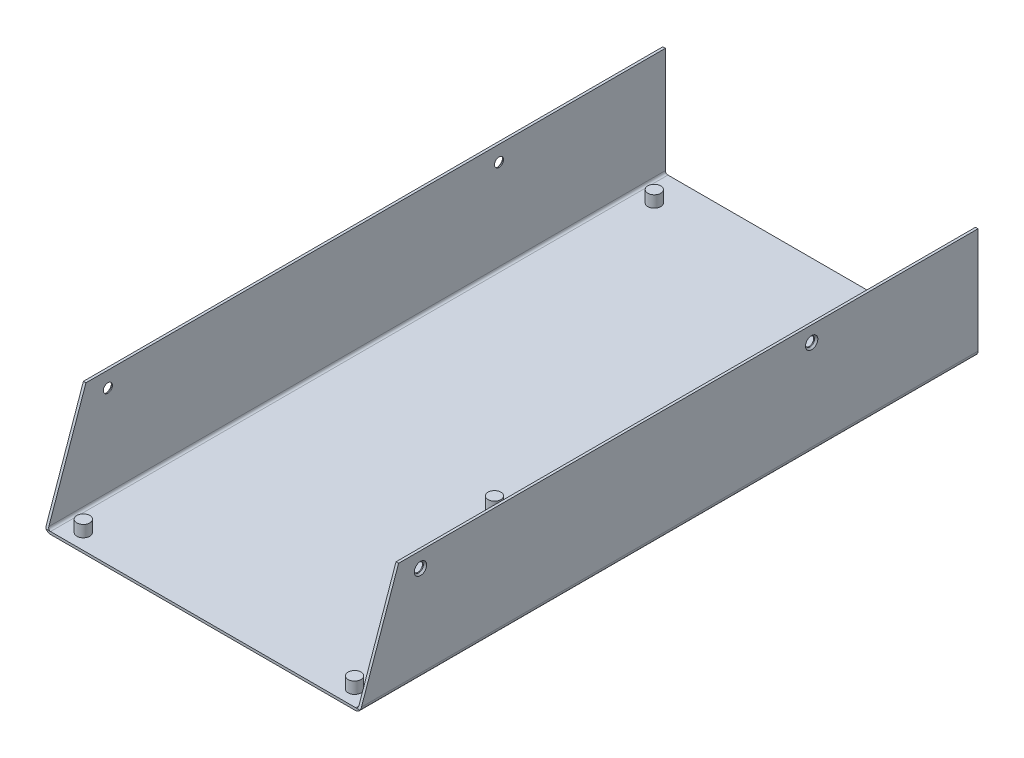
ISO-10303-21;
HEADER;
FILE_DESCRIPTION(('STEP AP214'),'2;1');
FILE_NAME('part.step','',(''),(''),'','','');
FILE_SCHEMA(('AUTOMOTIVE_DESIGN { 1 0 10303 214 1 1 1 1 }'));
ENDSEC;
DATA;
#1=APPLICATION_CONTEXT('core data for automotive mechanical design processes');
#2=APPLICATION_PROTOCOL_DEFINITION('international standard','automotive_design',2000,#1);
#3=PRODUCT_CONTEXT('',#1,'mechanical');
#4=PRODUCT('Part','Part','',(#3));
#5=PRODUCT_RELATED_PRODUCT_CATEGORY('part','',(#4));
#6=PRODUCT_DEFINITION_FORMATION('','',#4);
#7=PRODUCT_DEFINITION_CONTEXT('part definition',#1,'design');
#8=PRODUCT_DEFINITION('design','',#6,#7);
#9=PRODUCT_DEFINITION_SHAPE('','',#8);
#10=(LENGTH_UNIT() NAMED_UNIT(*) SI_UNIT(.MILLI.,.METRE.));
#11=(NAMED_UNIT(*) PLANE_ANGLE_UNIT() SI_UNIT($,.RADIAN.));
#12=(NAMED_UNIT(*) SI_UNIT($,.STERADIAN.) SOLID_ANGLE_UNIT());
#13=UNCERTAINTY_MEASURE_WITH_UNIT(LENGTH_MEASURE(1.E-05),#10,'distance_accuracy_value','');
#14=(GEOMETRIC_REPRESENTATION_CONTEXT(3) GLOBAL_UNCERTAINTY_ASSIGNED_CONTEXT((#13)) GLOBAL_UNIT_ASSIGNED_CONTEXT((#10,
#11,#12)) REPRESENTATION_CONTEXT('',''));
#15=CARTESIAN_POINT('',(0.,0.,0.));
#16=DIRECTION('',(0.,0.,1.));
#17=DIRECTION('',(1.,0.,0.));
#18=AXIS2_PLACEMENT_3D('',#15,#16,#17);
#19=CARTESIAN_POINT('',(120.0031128,0.9906,0.));
#20=DIRECTION('',(0.,-0.330401260882394,-0.943840562175267));
#21=DIRECTION('',(0.,0.943840562175267,-0.330401260882394));
#22=AXIS2_PLACEMENT_3D('',#19,#20,#21);
#23=PLANE('',#22);
#24=DIRECTION('',(-1.,0.,0.));
#25=VECTOR('',#24,1.);
#26=CARTESIAN_POINT('',(120.9996564,0.9906,0.));
#27=LINE('',#26,#25);
#28=CARTESIAN_POINT('',(121.730769529978,0.990600000000006,0.));
#29=VERTEX_POINT('',#28);
#30=CARTESIAN_POINT('',(120.015000000287,0.990600000000003,0.));
#31=VERTEX_POINT('',#30);
#32=EDGE_CURVE('E117',#29,#31,#27,.T.);
#33=ORIENTED_EDGE('',*,*,#32,.F.);
#34=CARTESIAN_POINT('',(120.015,1.9812,-0.34676989117291));
#35=DIRECTION('',(0.,-0.330401260882394,-0.943840562175267));
#36=DIRECTION('',(0.,-0.943840562175267,0.330401260882394));
#37=AXIS2_PLACEMENT_3D('',#34,#35,#36);
#38=ELLIPSE('',#37,2.09908334034082,1.98120000000002);
#39=CARTESIAN_POINT('',(121.9962,1.9812,-0.346769924921123));
#40=VERTEX_POINT('',#39);
#41=EDGE_CURVE('E246',#29,#40,#38,.F.);
#42=ORIENTED_EDGE('',*,*,#41,.T.);
#43=DIRECTION('',(0.,-0.943840562524939,0.330401259883503));
#44=VECTOR('',#43,1.);
#45=CARTESIAN_POINT('',(121.9962,43.0022,-14.7066000187628));
#46=LINE('',#45,#44);
#47=CARTESIAN_POINT('',(121.9962,43.0022,-14.7066000093814));
#48=VERTEX_POINT('',#47);
#49=EDGE_CURVE('E242',#48,#40,#46,.T.);
#50=ORIENTED_EDGE('',*,*,#49,.F.);
#51=DIRECTION('',(1.,0.,0.));
#52=VECTOR('',#51,1.);
#53=CARTESIAN_POINT('',(121.5009,43.0022,-14.7066));
#54=LINE('',#53,#52);
#55=CARTESIAN_POINT('',(121.0056,43.0022,-14.7066000093814));
#56=VERTEX_POINT('',#55);
#57=EDGE_CURVE('E153',#56,#48,#54,.T.);
#58=ORIENTED_EDGE('',*,*,#57,.F.);
#59=DIRECTION('',(0.,0.943840562524939,-0.330401259883503));
#60=VECTOR('',#59,1.);
#61=CARTESIAN_POINT('',(121.0056,1.9812,-0.346769958669363));
#62=LINE('',#61,#60);
#63=CARTESIAN_POINT('',(121.0056,1.9811999998221,-0.346769924858865));
#64=VERTEX_POINT('',#63);
#65=EDGE_CURVE('E151',#64,#56,#62,.T.);
#66=ORIENTED_EDGE('',*,*,#65,.F.);
#67=CARTESIAN_POINT('',(120.015,1.9812,-0.34676989117291));
#68=DIRECTION('',(0.,-0.330401260882394,-0.943840562175267));
#69=DIRECTION('',(0.,-0.943840562175267,0.330401260882394));
#70=AXIS2_PLACEMENT_3D('',#67,#68,#69);
#71=ELLIPSE('',#70,1.04954167017039,0.990599999999994);
#72=EDGE_CURVE('E128',#31,#64,#71,.F.);
#73=ORIENTED_EDGE('',*,*,#72,.F.);
#74=EDGE_LOOP('',(#33,#42,#50,#58,#66,#73));
#75=FACE_BOUND('',#74,.T.);
#76=ADVANCED_FACE('F32',(#75),#23,.F.);
#77=CARTESIAN_POINT('',(121.0056,43.0022,-238.9886));
#78=DIRECTION('',(0.,1.,0.));
#79=DIRECTION('',(0.,0.,1.));
#80=AXIS2_PLACEMENT_3D('',#77,#78,#79);
#81=PLANE('',#80);
#82=DIRECTION('',(-1.,0.,0.));
#83=VECTOR('',#82,1.);
#84=CARTESIAN_POINT('',(121.5009,43.0022,-238.9886));
#85=LINE('',#84,#83);
#86=CARTESIAN_POINT('',(121.9962,43.0022,-238.9886));
#87=VERTEX_POINT('',#86);
#88=CARTESIAN_POINT('',(121.005600001905,43.0022,-238.9886));
#89=VERTEX_POINT('',#88);
#90=EDGE_CURVE('E156',#87,#89,#85,.T.);
#91=ORIENTED_EDGE('',*,*,#90,.T.);
#92=DIRECTION('',(0.,0.,-1.));
#93=VECTOR('',#92,1.);
#94=CARTESIAN_POINT('',(121.0056,43.0022,-118.9517594544));
#95=LINE('',#94,#93);
#96=EDGE_CURVE('E239',#56,#89,#95,.T.);
#97=ORIENTED_EDGE('',*,*,#96,.F.);
#98=ORIENTED_EDGE('',*,*,#57,.T.);
#99=DIRECTION('',(0.,0.,1.));
#100=VECTOR('',#99,1.);
#101=CARTESIAN_POINT('',(121.9962,43.0022,-118.9517594544));
#102=LINE('',#101,#100);
#103=EDGE_CURVE('E241',#87,#48,#102,.T.);
#104=ORIENTED_EDGE('',*,*,#103,.F.);
#105=EDGE_LOOP('',(#91,#97,#98,#104));
#106=FACE_BOUND('',#105,.T.);
#107=ADVANCED_FACE('F351',(#106),#81,.T.);
#108=CARTESIAN_POINT('',(0.,0.9906,0.));
#109=DIRECTION('',(0.,-0.330401260882394,-0.943840562175267));
#110=DIRECTION('',(0.,0.943840562175267,-0.330401260882394));
#111=AXIS2_PLACEMENT_3D('',#108,#109,#110);
#112=PLANE('',#111);
#113=DIRECTION('',(1.,0.,0.));
#114=VECTOR('',#113,1.);
#115=CARTESIAN_POINT('',(0.4953,43.0022,-14.7066));
#116=LINE('',#115,#114);
#117=CARTESIAN_POINT('',(0.,43.0022,-14.7066000093814));
#118=VERTEX_POINT('',#117);
#119=CARTESIAN_POINT('',(0.9906,43.0022,-14.7066000093814));
#120=VERTEX_POINT('',#119);
#121=EDGE_CURVE('E254',#118,#120,#116,.T.);
#122=ORIENTED_EDGE('',*,*,#121,.F.);
#123=DIRECTION('',(0.,0.943840562524939,-0.330401259883503));
#124=VECTOR('',#123,1.);
#125=CARTESIAN_POINT('',(0.,1.9812,-0.346769958669363));
#126=LINE('',#125,#124);
#127=CARTESIAN_POINT('',(0.,1.9811999991873,-0.346769924636642));
#128=VERTEX_POINT('',#127);
#129=EDGE_CURVE('E250',#128,#118,#126,.T.);
#130=ORIENTED_EDGE('',*,*,#129,.F.);
#131=CARTESIAN_POINT('',(1.9812,1.9812,-0.34676989117291));
#132=DIRECTION('',(0.,-0.330401260882394,-0.943840562175267));
#133=DIRECTION('',(0.,-0.943840562175267,0.330401260882394));
#134=AXIS2_PLACEMENT_3D('',#131,#132,#133);
#135=ELLIPSE('',#134,2.0990833403408,1.9812);
#136=CARTESIAN_POINT('',(0.265430470022267,0.990600000000006,0.));
#137=VERTEX_POINT('',#136);
#138=EDGE_CURVE('E218',#128,#137,#135,.F.);
#139=ORIENTED_EDGE('',*,*,#138,.T.);
#140=DIRECTION('',(-1.,0.,0.));
#141=VECTOR('',#140,1.);
#142=CARTESIAN_POINT('',(0.9965436,0.9906,0.));
#143=LINE('',#142,#141);
#144=CARTESIAN_POINT('',(1.98119999990473,0.9906,0.));
#145=VERTEX_POINT('',#144);
#146=EDGE_CURVE('E259',#145,#137,#143,.T.);
#147=ORIENTED_EDGE('',*,*,#146,.F.);
#148=CARTESIAN_POINT('',(1.9812,1.9812,-0.34676989117291));
#149=DIRECTION('',(0.,-0.330401260882394,-0.943840562175267));
#150=DIRECTION('',(0.,-0.943840562175267,0.330401260882394));
#151=AXIS2_PLACEMENT_3D('',#148,#149,#150);
#152=ELLIPSE('',#151,1.0495416701704,0.9906);
#153=CARTESIAN_POINT('',(0.990600000000001,1.98119999959365,-0.346769924778889));
#154=VERTEX_POINT('',#153);
#155=EDGE_CURVE('E160',#154,#145,#152,.F.);
#156=ORIENTED_EDGE('',*,*,#155,.F.);
#157=DIRECTION('',(0.,-0.943840562524939,0.330401259883503));
#158=VECTOR('',#157,1.);
#159=CARTESIAN_POINT('',(0.9906,43.0022,-14.7066000187628));
#160=LINE('',#159,#158);
#161=EDGE_CURVE('E236',#120,#154,#160,.T.);
#162=ORIENTED_EDGE('',*,*,#161,.F.);
#163=EDGE_LOOP('',(#122,#130,#139,#147,#156,#162));
#164=FACE_BOUND('',#163,.T.);
#165=ADVANCED_FACE('F345',(#164),#112,.F.);
#166=CARTESIAN_POINT('',(0.,43.0022,-238.9886));
#167=DIRECTION('',(0.,1.,0.));
#168=DIRECTION('',(0.,0.,1.));
#169=AXIS2_PLACEMENT_3D('',#166,#167,#168);
#170=PLANE('',#169);
#171=DIRECTION('',(-1.,0.,0.));
#172=VECTOR('',#171,1.);
#173=CARTESIAN_POINT('',(0.4953,43.0022,-238.9886));
#174=LINE('',#173,#172);
#175=CARTESIAN_POINT('',(0.990599998095001,43.0022,-238.9886));
#176=VERTEX_POINT('',#175);
#177=CARTESIAN_POINT('',(0.,43.0022,-238.9886));
#178=VERTEX_POINT('',#177);
#179=EDGE_CURVE('E251',#176,#178,#174,.T.);
#180=ORIENTED_EDGE('',*,*,#179,.T.);
#181=DIRECTION('',(0.,0.,-1.));
#182=VECTOR('',#181,1.);
#183=CARTESIAN_POINT('',(0.,43.0022,-118.9517594544));
#184=LINE('',#183,#182);
#185=EDGE_CURVE('E208',#118,#178,#184,.T.);
#186=ORIENTED_EDGE('',*,*,#185,.F.);
#187=ORIENTED_EDGE('',*,*,#121,.T.);
#188=DIRECTION('',(0.,0.,1.));
#189=VECTOR('',#188,1.);
#190=CARTESIAN_POINT('',(0.9906,43.0022,-118.9517594544));
#191=LINE('',#190,#189);
#192=EDGE_CURVE('E235',#176,#120,#191,.T.);
#193=ORIENTED_EDGE('',*,*,#192,.F.);
#194=EDGE_LOOP('',(#180,#186,#187,#193));
#195=FACE_BOUND('',#194,.T.);
#196=ADVANCED_FACE('F195',(#195),#170,.T.);
#197=CARTESIAN_POINT('',(0.,1.9812,-238.9886));
#198=DIRECTION('',(-1.,0.,0.));
#199=DIRECTION('',(0.,0.,1.));
#200=AXIS2_PLACEMENT_3D('',#197,#198,#199);
#201=PLANE('',#200);
#202=CARTESIAN_POINT('',(0.,37.0078,-174.5996));
#203=DIRECTION('',(-1.,0.,0.));
#204=DIRECTION('',(0.,0.,1.));
#205=AXIS2_PLACEMENT_3D('',#202,#203,#204);
#206=CIRCLE('',#205,2.38760000000002);
#207=CARTESIAN_POINT('',(0.,37.0078,-172.212));
#208=VERTEX_POINT('',#207);
#209=EDGE_CURVE('E178',#208,#208,#206,.F.);
#210=ORIENTED_EDGE('',*,*,#209,.T.);
#211=EDGE_LOOP('',(#210));
#212=FACE_BOUND('',#211,.T.);
#213=CARTESIAN_POINT('',(0.,37.0078,-23.1902));
#214=DIRECTION('',(-1.,0.,0.));
#215=DIRECTION('',(0.,0.,1.));
#216=AXIS2_PLACEMENT_3D('',#213,#214,#215);
#217=CIRCLE('',#216,2.38760000000002);
#218=CARTESIAN_POINT('',(0.,37.0078,-20.8026));
#219=VERTEX_POINT('',#218);
#220=EDGE_CURVE('E175',#219,#219,#217,.F.);
#221=ORIENTED_EDGE('',*,*,#220,.T.);
#222=EDGE_LOOP('',(#221));
#223=FACE_BOUND('',#222,.T.);
#224=DIRECTION('',(0.,-1.,0.));
#225=VECTOR('',#224,1.);
#226=CARTESIAN_POINT('',(0.,21.5011,-238.9886));
#227=LINE('',#226,#225);
#228=CARTESIAN_POINT('',(0.,1.98119999959365,-238.9886));
#229=VERTEX_POINT('',#228);
#230=EDGE_CURVE('E202',#178,#229,#227,.T.);
#231=ORIENTED_EDGE('',*,*,#230,.T.);
#232=DIRECTION('',(0.,0.,-1.));
#233=VECTOR('',#232,1.);
#234=CARTESIAN_POINT('',(0.,1.9811999991873,-119.4943));
#235=LINE('',#234,#233);
#236=EDGE_CURVE('E205',#229,#128,#235,.F.);
#237=ORIENTED_EDGE('',*,*,#236,.T.);
#238=ORIENTED_EDGE('',*,*,#129,.T.);
#239=ORIENTED_EDGE('',*,*,#185,.T.);
#240=EDGE_LOOP('',(#231,#237,#238,#239));
#241=FACE_BOUND('',#240,.T.);
#242=ADVANCED_FACE('F191',(#212,#223,#241),#201,.T.);
#243=CARTESIAN_POINT('',(1.9812,1.9812,-238.9886));
#244=DIRECTION('',(0.,0.,1.));
#245=DIRECTION('',(1.,0.,0.));
#246=AXIS2_PLACEMENT_3D('',#243,#244,#245);
#247=CYLINDRICAL_SURFACE('',#246,1.9812);
#248=ORIENTED_EDGE('',*,*,#236,.F.);
#249=CARTESIAN_POINT('',(1.9812,1.9812,-238.9886));
#250=DIRECTION('',(0.,0.,1.));
#251=DIRECTION('',(1.,0.,0.));
#252=AXIS2_PLACEMENT_3D('',#249,#250,#251);
#253=CIRCLE('',#252,1.9812);
#254=CARTESIAN_POINT('',(1.9812,0.,-238.9886));
#255=VERTEX_POINT('',#254);
#256=EDGE_CURVE('E211',#229,#255,#253,.T.);
#257=ORIENTED_EDGE('',*,*,#256,.T.);
#258=DIRECTION('',(0.,0.,-1.));
#259=VECTOR('',#258,1.);
#260=CARTESIAN_POINT('',(1.9812,0.,-119.4943));
#261=LINE('',#260,#259);
#262=CARTESIAN_POINT('',(1.9812,0.,0.));
#263=VERTEX_POINT('',#262);
#264=EDGE_CURVE('E249',#263,#255,#261,.T.);
#265=ORIENTED_EDGE('',*,*,#264,.F.);
#266=CARTESIAN_POINT('',(1.9812,1.9812,0.));
#267=DIRECTION('',(0.,0.,1.));
#268=DIRECTION('',(1.,0.,0.));
#269=AXIS2_PLACEMENT_3D('',#266,#267,#268);
#270=CIRCLE('',#269,1.9812);
#271=EDGE_CURVE('E232',#137,#263,#270,.T.);
#272=ORIENTED_EDGE('',*,*,#271,.F.);
#273=ORIENTED_EDGE('',*,*,#138,.F.);
#274=EDGE_LOOP('',(#248,#257,#265,#272,#273));
#275=FACE_BOUND('',#274,.T.);
#276=ADVANCED_FACE('F194',(#275),#247,.T.);
#277=CARTESIAN_POINT('',(1.9812,0.,0.));
#278=DIRECTION('',(0.,-1.,0.));
#279=DIRECTION('',(0.,0.,-1.));
#280=AXIS2_PLACEMENT_3D('',#277,#278,#279);
#281=PLANE('',#280);
#282=DIRECTION('',(1.,0.,0.));
#283=VECTOR('',#282,1.);
#284=CARTESIAN_POINT('',(60.9981,0.,-238.9886));
#285=LINE('',#284,#283);
#286=CARTESIAN_POINT('',(120.014999999619,0.,-238.9886));
#287=VERTEX_POINT('',#286);
#288=EDGE_CURVE('E223',#255,#287,#285,.T.);
#289=ORIENTED_EDGE('',*,*,#288,.T.);
#290=DIRECTION('',(0.,0.,-1.));
#291=VECTOR('',#290,1.);
#292=CARTESIAN_POINT('',(120.014999999238,0.,-119.4943));
#293=LINE('',#292,#291);
#294=CARTESIAN_POINT('',(120.014999999619,0.,0.));
#295=VERTEX_POINT('',#294);
#296=EDGE_CURVE('E248',#287,#295,#293,.F.);
#297=ORIENTED_EDGE('',*,*,#296,.T.);
#298=DIRECTION('',(1.,0.,0.));
#299=VECTOR('',#298,1.);
#300=CARTESIAN_POINT('',(60.9981,0.,0.));
#301=LINE('',#300,#299);
#302=EDGE_CURVE('E231',#263,#295,#301,.T.);
#303=ORIENTED_EDGE('',*,*,#302,.F.);
#304=ORIENTED_EDGE('',*,*,#264,.T.);
#305=EDGE_LOOP('',(#289,#297,#303,#304));
#306=FACE_BOUND('',#305,.T.);
#307=ADVANCED_FACE('F342',(#306),#281,.T.);
#308=CARTESIAN_POINT('',(120.015,1.9812,-238.9886));
#309=DIRECTION('',(0.,0.,1.));
#310=DIRECTION('',(1.,0.,0.));
#311=AXIS2_PLACEMENT_3D('',#308,#309,#310);
#312=CYLINDRICAL_SURFACE('',#311,1.98120000000002);
#313=CARTESIAN_POINT('',(120.015,1.9812,0.));
#314=DIRECTION('',(0.,0.,1.));
#315=DIRECTION('',(1.,0.,0.));
#316=AXIS2_PLACEMENT_3D('',#313,#314,#315);
#317=CIRCLE('',#316,1.98120000000002);
#318=EDGE_CURVE('E124',#295,#29,#317,.T.);
#319=ORIENTED_EDGE('',*,*,#318,.F.);
#320=ORIENTED_EDGE('',*,*,#296,.F.);
#321=CARTESIAN_POINT('',(120.015,1.9812,-238.9886));
#322=DIRECTION('',(0.,0.,1.));
#323=DIRECTION('',(1.,0.,0.));
#324=AXIS2_PLACEMENT_3D('',#321,#322,#323);
#325=CIRCLE('',#324,1.98120000000002);
#326=CARTESIAN_POINT('',(121.9962,1.9812,-238.9886));
#327=VERTEX_POINT('',#326);
#328=EDGE_CURVE('E225',#287,#327,#325,.T.);
#329=ORIENTED_EDGE('',*,*,#328,.T.);
#330=DIRECTION('',(0.,0.,-1.));
#331=VECTOR('',#330,1.);
#332=CARTESIAN_POINT('',(121.9962,1.9812,-118.9517594544));
#333=LINE('',#332,#331);
#334=EDGE_CURVE('E245',#40,#327,#333,.T.);
#335=ORIENTED_EDGE('',*,*,#334,.F.);
#336=ORIENTED_EDGE('',*,*,#41,.F.);
#337=EDGE_LOOP('',(#319,#320,#329,#335,#336));
#338=FACE_BOUND('',#337,.T.);
#339=ADVANCED_FACE('F394',(#338),#312,.T.);
#340=CARTESIAN_POINT('',(121.9962,1.9812,1.0850810912));
#341=DIRECTION('',(1.,0.,0.));
#342=DIRECTION('',(0.,0.,-1.));
#343=AXIS2_PLACEMENT_3D('',#340,#341,#342);
#344=PLANE('',#343);
#345=CARTESIAN_POINT('',(121.9962,37.0078,-174.5996));
#346=DIRECTION('',(1.,0.,0.));
#347=DIRECTION('',(0.,0.,-1.));
#348=AXIS2_PLACEMENT_3D('',#345,#346,#347);
#349=CIRCLE('',#348,2.38759999999999);
#350=CARTESIAN_POINT('',(121.9962,37.0078,-176.9872));
#351=VERTEX_POINT('',#350);
#352=EDGE_CURVE('E169',#351,#351,#349,.F.);
#353=ORIENTED_EDGE('',*,*,#352,.T.);
#354=EDGE_LOOP('',(#353));
#355=FACE_BOUND('',#354,.T.);
#356=CARTESIAN_POINT('',(121.9962,37.0078,-23.1902));
#357=DIRECTION('',(1.,0.,0.));
#358=DIRECTION('',(0.,0.,-1.));
#359=AXIS2_PLACEMENT_3D('',#356,#357,#358);
#360=CIRCLE('',#359,2.38760000000007);
#361=CARTESIAN_POINT('',(121.9962,37.0078,-25.5778000000001));
#362=VERTEX_POINT('',#361);
#363=EDGE_CURVE('E162',#362,#362,#360,.F.);
#364=ORIENTED_EDGE('',*,*,#363,.T.);
#365=EDGE_LOOP('',(#364));
#366=FACE_BOUND('',#365,.T.);
#367=DIRECTION('',(0.,1.,0.));
#368=VECTOR('',#367,1.);
#369=CARTESIAN_POINT('',(121.9962,21.5011,-238.9886));
#370=LINE('',#369,#368);
#371=EDGE_CURVE('E304',#327,#87,#370,.T.);
#372=ORIENTED_EDGE('',*,*,#371,.T.);
#373=ORIENTED_EDGE('',*,*,#103,.T.);
#374=ORIENTED_EDGE('',*,*,#49,.T.);
#375=ORIENTED_EDGE('',*,*,#334,.T.);
#376=EDGE_LOOP('',(#372,#373,#374,#375));
#377=FACE_BOUND('',#376,.T.);
#378=ADVANCED_FACE('F397',(#355,#366,#377),#344,.T.);
#379=CARTESIAN_POINT('',(121.0056,1.9812,-238.9886));
#380=DIRECTION('',(-1.,0.,0.));
#381=DIRECTION('',(0.,0.,1.));
#382=AXIS2_PLACEMENT_3D('',#379,#380,#381);
#383=PLANE('',#382);
#384=CARTESIAN_POINT('',(121.0056,37.0078,-174.5996));
#385=DIRECTION('',(-1.,0.,0.));
#386=DIRECTION('',(0.,0.,1.));
#387=AXIS2_PLACEMENT_3D('',#384,#385,#386);
#388=CIRCLE('',#387,1.7526);
#389=CARTESIAN_POINT('',(121.0056,37.0078,-172.847));
#390=VERTEX_POINT('',#389);
#391=EDGE_CURVE('E627',#390,#390,#388,.T.);
#392=ORIENTED_EDGE('',*,*,#391,.F.);
#393=EDGE_LOOP('',(#392));
#394=FACE_BOUND('',#393,.T.);
#395=CARTESIAN_POINT('',(121.0056,37.0078,-23.1902));
#396=DIRECTION('',(-1.,0.,0.));
#397=DIRECTION('',(0.,0.,1.));
#398=AXIS2_PLACEMENT_3D('',#395,#396,#397);
#399=CIRCLE('',#398,1.7526);
#400=CARTESIAN_POINT('',(121.0056,37.0078,-21.4376));
#401=VERTEX_POINT('',#400);
#402=EDGE_CURVE('E129',#401,#401,#399,.T.);
#403=ORIENTED_EDGE('',*,*,#402,.F.);
#404=EDGE_LOOP('',(#403));
#405=FACE_BOUND('',#404,.T.);
#406=DIRECTION('',(0.,-1.,0.));
#407=VECTOR('',#406,1.);
#408=CARTESIAN_POINT('',(121.005600005715,21.5011,-238.9886));
#409=LINE('',#408,#407);
#410=CARTESIAN_POINT('',(121.005600002857,1.98119999991105,-238.9886));
#411=VERTEX_POINT('',#410);
#412=EDGE_CURVE('E301',#89,#411,#409,.T.);
#413=ORIENTED_EDGE('',*,*,#412,.T.);
#414=DIRECTION('',(0.,0.,1.));
#415=VECTOR('',#414,1.);
#416=CARTESIAN_POINT('',(121.0056,1.9811999998221,-118.7773342));
#417=LINE('',#416,#415);
#418=EDGE_CURVE('E212',#64,#411,#417,.F.);
#419=ORIENTED_EDGE('',*,*,#418,.F.);
#420=ORIENTED_EDGE('',*,*,#65,.T.);
#421=ORIENTED_EDGE('',*,*,#96,.T.);
#422=EDGE_LOOP('',(#413,#419,#420,#421));
#423=FACE_BOUND('',#422,.T.);
#424=ADVANCED_FACE('F411',(#394,#405,#423),#383,.T.);
#425=CARTESIAN_POINT('',(0.9906,1.9812,1.0850810912));
#426=DIRECTION('',(1.,0.,0.));
#427=DIRECTION('',(0.,0.,-1.));
#428=AXIS2_PLACEMENT_3D('',#425,#426,#427);
#429=PLANE('',#428);
#430=CARTESIAN_POINT('',(0.9906,37.0078,-174.5996));
#431=DIRECTION('',(1.,0.,0.));
#432=DIRECTION('',(0.,0.,-1.));
#433=AXIS2_PLACEMENT_3D('',#430,#431,#432);
#434=CIRCLE('',#433,1.7526);
#435=CARTESIAN_POINT('',(0.9906,37.0078,-176.3522));
#436=VERTEX_POINT('',#435);
#437=EDGE_CURVE('E628',#436,#436,#434,.T.);
#438=ORIENTED_EDGE('',*,*,#437,.F.);
#439=EDGE_LOOP('',(#438));
#440=FACE_BOUND('',#439,.T.);
#441=CARTESIAN_POINT('',(0.9906,37.0078,-23.1902));
#442=DIRECTION('',(1.,0.,0.));
#443=DIRECTION('',(0.,0.,-1.));
#444=AXIS2_PLACEMENT_3D('',#441,#442,#443);
#445=CIRCLE('',#444,1.7526);
#446=CARTESIAN_POINT('',(0.9906,37.0078,-24.9428));
#447=VERTEX_POINT('',#446);
#448=EDGE_CURVE('E626',#447,#447,#445,.T.);
#449=ORIENTED_EDGE('',*,*,#448,.F.);
#450=EDGE_LOOP('',(#449));
#451=FACE_BOUND('',#450,.T.);
#452=DIRECTION('',(0.,1.,0.));
#453=VECTOR('',#452,1.);
#454=CARTESIAN_POINT('',(0.990599994285,21.5011,-238.9886));
#455=LINE('',#454,#453);
#456=CARTESIAN_POINT('',(0.9905999971425,1.98119999979683,-238.9886));
#457=VERTEX_POINT('',#456);
#458=EDGE_CURVE('E300',#457,#176,#455,.T.);
#459=ORIENTED_EDGE('',*,*,#458,.T.);
#460=ORIENTED_EDGE('',*,*,#192,.T.);
#461=ORIENTED_EDGE('',*,*,#161,.T.);
#462=DIRECTION('',(0.,0.,-1.));
#463=VECTOR('',#462,1.);
#464=CARTESIAN_POINT('',(0.990600000000001,1.98119999959365,-118.7773342));
#465=LINE('',#464,#463);
#466=EDGE_CURVE('E299',#457,#154,#465,.F.);
#467=ORIENTED_EDGE('',*,*,#466,.F.);
#468=EDGE_LOOP('',(#459,#460,#461,#467));
#469=FACE_BOUND('',#468,.T.);
#470=ADVANCED_FACE('F416',(#440,#451,#469),#429,.T.);
#471=CARTESIAN_POINT('',(116.2223228,5.4864,-204.1571228));
#472=DIRECTION('',(0.,1.,0.));
#473=DIRECTION('',(-1.,0.,0.));
#474=AXIS2_PLACEMENT_3D('',#471,#472,#473);
#475=PLANE('',#474);
#476=CARTESIAN_POINT('',(113.6904,5.4864,-201.6252));
#477=DIRECTION('',(0.,-1.,0.));
#478=DIRECTION('',(0.,0.,-1.));
#479=AXIS2_PLACEMENT_3D('',#476,#477,#478);
#480=CIRCLE('',#479,2.50189999999996);
#481=CARTESIAN_POINT('',(113.6904,5.4864,-204.1271));
#482=VERTEX_POINT('',#481);
#483=EDGE_CURVE('E296',#482,#482,#480,.F.);
#484=ORIENTED_EDGE('',*,*,#483,.T.);
#485=EDGE_LOOP('',(#484));
#486=FACE_BOUND('',#485,.T.);
#487=ADVANCED_FACE('F418',(#486),#475,.T.);
#488=CARTESIAN_POINT('',(82.9737228,5.4864,-95.9023228));
#489=DIRECTION('',(0.,1.,0.));
#490=DIRECTION('',(-1.,0.,0.));
#491=AXIS2_PLACEMENT_3D('',#488,#489,#490);
#492=PLANE('',#491);
#493=CARTESIAN_POINT('',(80.4418,5.4864,-93.3704));
#494=DIRECTION('',(0.,-1.,0.));
#495=DIRECTION('',(0.,0.,-1.));
#496=AXIS2_PLACEMENT_3D('',#493,#494,#495);
#497=CIRCLE('',#496,2.5019);
#498=CARTESIAN_POINT('',(80.4418,5.4864,-95.8723));
#499=VERTEX_POINT('',#498);
#500=EDGE_CURVE('E293',#499,#499,#497,.F.);
#501=ORIENTED_EDGE('',*,*,#500,.T.);
#502=EDGE_LOOP('',(#501));
#503=FACE_BOUND('',#502,.T.);
#504=ADVANCED_FACE('F425',(#503),#492,.T.);
#505=CARTESIAN_POINT('',(116.2223228,5.4864,-8.5263228));
#506=DIRECTION('',(0.,1.,0.));
#507=DIRECTION('',(-1.,0.,0.));
#508=AXIS2_PLACEMENT_3D('',#505,#506,#507);
#509=PLANE('',#508);
#510=CARTESIAN_POINT('',(113.6904,5.4864,-5.9944));
#511=DIRECTION('',(0.,-1.,0.));
#512=DIRECTION('',(0.,0.,-1.));
#513=AXIS2_PLACEMENT_3D('',#510,#511,#512);
#514=CIRCLE('',#513,2.50189999999996);
#515=CARTESIAN_POINT('',(113.6904,5.4864,-8.49629999999996));
#516=VERTEX_POINT('',#515);
#517=EDGE_CURVE('E290',#516,#516,#514,.F.);
#518=ORIENTED_EDGE('',*,*,#517,.T.);
#519=EDGE_LOOP('',(#518));
#520=FACE_BOUND('',#519,.T.);
#521=ADVANCED_FACE('F436',(#520),#509,.T.);
#522=CARTESIAN_POINT('',(11.2187228,5.4864,-8.5263228));
#523=DIRECTION('',(0.,1.,0.));
#524=DIRECTION('',(-1.,0.,0.));
#525=AXIS2_PLACEMENT_3D('',#522,#523,#524);
#526=PLANE('',#525);
#527=CARTESIAN_POINT('',(8.6868,5.4864,-5.9944));
#528=DIRECTION('',(0.,-1.,0.));
#529=DIRECTION('',(0.,0.,-1.));
#530=AXIS2_PLACEMENT_3D('',#527,#528,#529);
#531=CIRCLE('',#530,2.5019);
#532=CARTESIAN_POINT('',(8.6868,5.4864,-8.4963));
#533=VERTEX_POINT('',#532);
#534=EDGE_CURVE('E139',#533,#533,#531,.F.);
#535=ORIENTED_EDGE('',*,*,#534,.T.);
#536=EDGE_LOOP('',(#535));
#537=FACE_BOUND('',#536,.T.);
#538=ADVANCED_FACE('F440',(#537),#526,.T.);
#539=CARTESIAN_POINT('',(-0.4633615574,0.,0.));
#540=DIRECTION('',(0.,0.,1.));
#541=DIRECTION('',(1.,0.,0.));
#542=AXIS2_PLACEMENT_3D('',#539,#540,#541);
#543=PLANE('',#542);
#544=ORIENTED_EDGE('',*,*,#32,.T.);
#545=DIRECTION('',(1.,0.,0.));
#546=VECTOR('',#545,1.);
#547=CARTESIAN_POINT('',(60.9981,0.9906,0.));
#548=LINE('',#547,#546);
#549=EDGE_CURVE('E120',#145,#31,#548,.T.);
#550=ORIENTED_EDGE('',*,*,#549,.F.);
#551=ORIENTED_EDGE('',*,*,#146,.T.);
#552=ORIENTED_EDGE('',*,*,#271,.T.);
#553=ORIENTED_EDGE('',*,*,#302,.T.);
#554=ORIENTED_EDGE('',*,*,#318,.T.);
#555=EDGE_LOOP('',(#544,#550,#551,#552,#553,#554));
#556=FACE_BOUND('',#555,.T.);
#557=ADVANCED_FACE('F119',(#556),#543,.T.);
#558=CARTESIAN_POINT('',(120.015,1.9812,-238.9886));
#559=DIRECTION('',(0.,0.,1.));
#560=DIRECTION('',(1.,0.,0.));
#561=AXIS2_PLACEMENT_3D('',#558,#559,#560);
#562=CYLINDRICAL_SURFACE('',#561,0.990599999999994);
#563=CARTESIAN_POINT('',(120.015,1.9812,-238.9886));
#564=DIRECTION('',(0.,0.,1.));
#565=DIRECTION('',(1.,0.,0.));
#566=AXIS2_PLACEMENT_3D('',#563,#564,#565);
#567=CIRCLE('',#566,0.990599999999994);
#568=CARTESIAN_POINT('',(120.015,0.9906,-238.9886));
#569=VERTEX_POINT('',#568);
#570=EDGE_CURVE('E147',#411,#569,#567,.F.);
#571=ORIENTED_EDGE('',*,*,#570,.T.);
#572=DIRECTION('',(0.,0.,-1.));
#573=VECTOR('',#572,1.);
#574=CARTESIAN_POINT('',(120.015,0.9906,-119.4943));
#575=LINE('',#574,#573);
#576=EDGE_CURVE('E137',#31,#569,#575,.T.);
#577=ORIENTED_EDGE('',*,*,#576,.F.);
#578=ORIENTED_EDGE('',*,*,#72,.T.);
#579=ORIENTED_EDGE('',*,*,#418,.T.);
#580=EDGE_LOOP('',(#571,#577,#578,#579));
#581=FACE_BOUND('',#580,.T.);
#582=ADVANCED_FACE('F143',(#581),#562,.F.);
#583=CARTESIAN_POINT('',(0.,0.,-238.9886));
#584=DIRECTION('',(0.,0.,1.));
#585=DIRECTION('',(1.,0.,0.));
#586=AXIS2_PLACEMENT_3D('',#583,#584,#585);
#587=PLANE('',#586);
#588=ORIENTED_EDGE('',*,*,#458,.F.);
#589=CARTESIAN_POINT('',(1.9812,1.9812,-238.9886));
#590=DIRECTION('',(0.,0.,1.));
#591=DIRECTION('',(1.,0.,0.));
#592=AXIS2_PLACEMENT_3D('',#589,#590,#591);
#593=CIRCLE('',#592,0.9906);
#594=CARTESIAN_POINT('',(1.9812,0.9906,-238.9886));
#595=VERTEX_POINT('',#594);
#596=EDGE_CURVE('E49',#595,#457,#593,.F.);
#597=ORIENTED_EDGE('',*,*,#596,.F.);
#598=DIRECTION('',(-1.,0.,0.));
#599=VECTOR('',#598,1.);
#600=CARTESIAN_POINT('',(60.9981,0.9906,-238.9886));
#601=LINE('',#600,#599);
#602=EDGE_CURVE('E148',#569,#595,#601,.T.);
#603=ORIENTED_EDGE('',*,*,#602,.F.);
#604=ORIENTED_EDGE('',*,*,#570,.F.);
#605=ORIENTED_EDGE('',*,*,#412,.F.);
#606=ORIENTED_EDGE('',*,*,#90,.F.);
#607=ORIENTED_EDGE('',*,*,#371,.F.);
#608=ORIENTED_EDGE('',*,*,#328,.F.);
#609=ORIENTED_EDGE('',*,*,#288,.F.);
#610=ORIENTED_EDGE('',*,*,#256,.F.);
#611=ORIENTED_EDGE('',*,*,#230,.F.);
#612=ORIENTED_EDGE('',*,*,#179,.F.);
#613=EDGE_LOOP('',(#588,#597,#603,#604,#605,#606,#607,#608,#609,#610,#611,#612));
#614=FACE_BOUND('',#613,.T.);
#615=ADVANCED_FACE('F221',(#614),#587,.F.);
#616=CARTESIAN_POINT('',(1.9812,1.9812,-238.9886));
#617=DIRECTION('',(0.,0.,1.));
#618=DIRECTION('',(1.,0.,0.));
#619=AXIS2_PLACEMENT_3D('',#616,#617,#618);
#620=CYLINDRICAL_SURFACE('',#619,0.9906);
#621=ORIENTED_EDGE('',*,*,#596,.T.);
#622=ORIENTED_EDGE('',*,*,#466,.T.);
#623=ORIENTED_EDGE('',*,*,#155,.T.);
#624=DIRECTION('',(0.,0.,1.));
#625=VECTOR('',#624,1.);
#626=CARTESIAN_POINT('',(1.9812,0.9906,-119.4943));
#627=LINE('',#626,#625);
#628=EDGE_CURVE('E138',#595,#145,#627,.T.);
#629=ORIENTED_EDGE('',*,*,#628,.F.);
#630=EDGE_LOOP('',(#621,#622,#623,#629));
#631=FACE_BOUND('',#630,.T.);
#632=ADVANCED_FACE('F387',(#631),#620,.F.);
#633=CARTESIAN_POINT('',(113.6904,5.4864,-201.6252));
#634=DIRECTION('',(0.,-1.,0.));
#635=DIRECTION('',(0.,0.,-1.));
#636=AXIS2_PLACEMENT_3D('',#633,#634,#635);
#637=CYLINDRICAL_SURFACE('',#636,2.50189999999996);
#638=CARTESIAN_POINT('',(113.6904,0.9906,-201.6252));
#639=DIRECTION('',(0.,-1.,0.));
#640=DIRECTION('',(0.,0.,-1.));
#641=AXIS2_PLACEMENT_3D('',#638,#639,#640);
#642=CIRCLE('',#641,2.50189999999996);
#643=CARTESIAN_POINT('',(113.6904,0.9906,-204.1271));
#644=VERTEX_POINT('',#643);
#645=EDGE_CURVE('E285',#644,#644,#642,.T.);
#646=ORIENTED_EDGE('',*,*,#645,.F.);
#647=EDGE_LOOP('',(#646));
#648=FACE_BOUND('',#647,.T.);
#649=ORIENTED_EDGE('',*,*,#483,.F.);
#650=EDGE_LOOP('',(#649));
#651=FACE_BOUND('',#650,.T.);
#652=ADVANCED_FACE('F383',(#648,#651),#637,.T.);
#653=CARTESIAN_POINT('',(80.4418,5.4864,-93.3704));
#654=DIRECTION('',(0.,-1.,0.));
#655=DIRECTION('',(0.,0.,-1.));
#656=AXIS2_PLACEMENT_3D('',#653,#654,#655);
#657=CYLINDRICAL_SURFACE('',#656,2.5019);
#658=CARTESIAN_POINT('',(80.4418,0.9906,-93.3704));
#659=DIRECTION('',(0.,-1.,0.));
#660=DIRECTION('',(0.,0.,-1.));
#661=AXIS2_PLACEMENT_3D('',#658,#659,#660);
#662=CIRCLE('',#661,2.5019);
#663=CARTESIAN_POINT('',(80.4418,0.9906,-95.8723));
#664=VERTEX_POINT('',#663);
#665=EDGE_CURVE('E282',#664,#664,#662,.T.);
#666=ORIENTED_EDGE('',*,*,#665,.F.);
#667=EDGE_LOOP('',(#666));
#668=FACE_BOUND('',#667,.T.);
#669=ORIENTED_EDGE('',*,*,#500,.F.);
#670=EDGE_LOOP('',(#669));
#671=FACE_BOUND('',#670,.T.);
#672=ADVANCED_FACE('F379',(#668,#671),#657,.T.);
#673=CARTESIAN_POINT('',(113.6904,5.4864,-5.9944));
#674=DIRECTION('',(0.,-1.,0.));
#675=DIRECTION('',(0.,0.,-1.));
#676=AXIS2_PLACEMENT_3D('',#673,#674,#675);
#677=CYLINDRICAL_SURFACE('',#676,2.50189999999996);
#678=CARTESIAN_POINT('',(113.6904,0.9906,-5.9944));
#679=DIRECTION('',(0.,-1.,0.));
#680=DIRECTION('',(0.,0.,-1.));
#681=AXIS2_PLACEMENT_3D('',#678,#679,#680);
#682=CIRCLE('',#681,2.50189999999996);
#683=CARTESIAN_POINT('',(113.6904,0.9906,-8.49629999999996));
#684=VERTEX_POINT('',#683);
#685=EDGE_CURVE('E279',#684,#684,#682,.T.);
#686=ORIENTED_EDGE('',*,*,#685,.F.);
#687=EDGE_LOOP('',(#686));
#688=FACE_BOUND('',#687,.T.);
#689=ORIENTED_EDGE('',*,*,#517,.F.);
#690=EDGE_LOOP('',(#689));
#691=FACE_BOUND('',#690,.T.);
#692=ADVANCED_FACE('F375',(#688,#691),#677,.T.);
#693=CARTESIAN_POINT('',(8.6868,5.4864,-5.9944));
#694=DIRECTION('',(0.,-1.,0.));
#695=DIRECTION('',(0.,0.,-1.));
#696=AXIS2_PLACEMENT_3D('',#693,#694,#695);
#697=CYLINDRICAL_SURFACE('',#696,2.5019);
#698=CARTESIAN_POINT('',(8.6868,0.9906,-5.9944));
#699=DIRECTION('',(0.,-1.,0.));
#700=DIRECTION('',(0.,0.,-1.));
#701=AXIS2_PLACEMENT_3D('',#698,#699,#700);
#702=CIRCLE('',#701,2.5019);
#703=CARTESIAN_POINT('',(8.6868,0.9906,-8.4963));
#704=VERTEX_POINT('',#703);
#705=EDGE_CURVE('E276',#704,#704,#702,.T.);
#706=ORIENTED_EDGE('',*,*,#705,.F.);
#707=EDGE_LOOP('',(#706));
#708=FACE_BOUND('',#707,.T.);
#709=ORIENTED_EDGE('',*,*,#534,.F.);
#710=EDGE_LOOP('',(#709));
#711=FACE_BOUND('',#710,.T.);
#712=ADVANCED_FACE('F372',(#708,#711),#697,.T.);
#713=CARTESIAN_POINT('',(120.015,0.9906,-238.9886));
#714=DIRECTION('',(0.,1.,0.));
#715=DIRECTION('',(-1.,0.,0.));
#716=AXIS2_PLACEMENT_3D('',#713,#714,#715);
#717=PLANE('',#716);
#718=ORIENTED_EDGE('',*,*,#705,.T.);
#719=EDGE_LOOP('',(#718));
#720=FACE_BOUND('',#719,.T.);
#721=ORIENTED_EDGE('',*,*,#685,.T.);
#722=EDGE_LOOP('',(#721));
#723=FACE_BOUND('',#722,.T.);
#724=ORIENTED_EDGE('',*,*,#665,.T.);
#725=EDGE_LOOP('',(#724));
#726=FACE_BOUND('',#725,.T.);
#727=ORIENTED_EDGE('',*,*,#645,.T.);
#728=EDGE_LOOP('',(#727));
#729=FACE_BOUND('',#728,.T.);
#730=CARTESIAN_POINT('',(8.6868,0.9906,-226.9998));
#731=DIRECTION('',(0.,-1.,0.));
#732=DIRECTION('',(0.,0.,-1.));
#733=AXIS2_PLACEMENT_3D('',#730,#731,#732);
#734=CIRCLE('',#733,2.5019);
#735=CARTESIAN_POINT('',(8.6868,0.9906,-229.5017));
#736=VERTEX_POINT('',#735);
#737=EDGE_CURVE('E273',#736,#736,#734,.T.);
#738=ORIENTED_EDGE('',*,*,#737,.T.);
#739=EDGE_LOOP('',(#738));
#740=FACE_BOUND('',#739,.T.);
#741=ORIENTED_EDGE('',*,*,#602,.T.);
#742=ORIENTED_EDGE('',*,*,#628,.T.);
#743=ORIENTED_EDGE('',*,*,#549,.T.);
#744=ORIENTED_EDGE('',*,*,#576,.T.);
#745=EDGE_LOOP('',(#741,#742,#743,#744));
#746=FACE_BOUND('',#745,.T.);
#747=ADVANCED_FACE('F136',(#720,#723,#726,#729,#740,#746),#717,.T.);
#748=CARTESIAN_POINT('',(11.2187228,5.4864,-229.5317228));
#749=DIRECTION('',(0.,1.,0.));
#750=DIRECTION('',(-1.,0.,0.));
#751=AXIS2_PLACEMENT_3D('',#748,#749,#750);
#752=PLANE('',#751);
#753=CARTESIAN_POINT('',(8.6868,5.4864,-226.9998));
#754=DIRECTION('',(0.,-1.,0.));
#755=DIRECTION('',(0.,0.,-1.));
#756=AXIS2_PLACEMENT_3D('',#753,#754,#755);
#757=CIRCLE('',#756,2.5019);
#758=CARTESIAN_POINT('',(8.6868,5.4864,-229.5017));
#759=VERTEX_POINT('',#758);
#760=EDGE_CURVE('E166',#759,#759,#757,.F.);
#761=ORIENTED_EDGE('',*,*,#760,.T.);
#762=EDGE_LOOP('',(#761));
#763=FACE_BOUND('',#762,.T.);
#764=ADVANCED_FACE('F356',(#763),#752,.T.);
#765=CARTESIAN_POINT('',(8.6868,5.4864,-226.9998));
#766=DIRECTION('',(0.,-1.,0.));
#767=DIRECTION('',(0.,0.,-1.));
#768=AXIS2_PLACEMENT_3D('',#765,#766,#767);
#769=CYLINDRICAL_SURFACE('',#768,2.5019);
#770=ORIENTED_EDGE('',*,*,#737,.F.);
#771=EDGE_LOOP('',(#770));
#772=FACE_BOUND('',#771,.T.);
#773=ORIENTED_EDGE('',*,*,#760,.F.);
#774=EDGE_LOOP('',(#773));
#775=FACE_BOUND('',#774,.T.);
#776=ADVANCED_FACE('F353',(#772,#775),#769,.T.);
#777=CARTESIAN_POINT('',(121.9962,37.0078,-23.1902));
#778=DIRECTION('',(-1.,0.,0.));
#779=DIRECTION('',(0.,0.,1.));
#780=AXIS2_PLACEMENT_3D('',#777,#778,#779);
#781=CYLINDRICAL_SURFACE('',#780,1.7526);
#782=CARTESIAN_POINT('',(121.3612,37.0078,-23.1902));
#783=DIRECTION('',(1.,0.,0.));
#784=DIRECTION('',(0.,0.,-1.));
#785=AXIS2_PLACEMENT_3D('',#782,#783,#784);
#786=CIRCLE('',#785,1.7526);
#787=CARTESIAN_POINT('',(121.3612,37.0078,-24.9428));
#788=VERTEX_POINT('',#787);
#789=EDGE_CURVE('E165',#788,#788,#786,.T.);
#790=ORIENTED_EDGE('',*,*,#789,.T.);
#791=EDGE_LOOP('',(#790));
#792=FACE_BOUND('',#791,.T.);
#793=ORIENTED_EDGE('',*,*,#402,.T.);
#794=EDGE_LOOP('',(#793));
#795=FACE_BOUND('',#794,.T.);
#796=ADVANCED_FACE('F355',(#792,#795),#781,.F.);
#797=CARTESIAN_POINT('',(121.9962,37.0078,-174.5996));
#798=DIRECTION('',(-1.,0.,0.));
#799=DIRECTION('',(0.,0.,1.));
#800=AXIS2_PLACEMENT_3D('',#797,#798,#799);
#801=CYLINDRICAL_SURFACE('',#800,1.7526);
#802=CARTESIAN_POINT('',(121.3612,37.0078,-174.5996));
#803=DIRECTION('',(1.,0.,0.));
#804=DIRECTION('',(0.,0.,-1.));
#805=AXIS2_PLACEMENT_3D('',#802,#803,#804);
#806=CIRCLE('',#805,1.7526);
#807=CARTESIAN_POINT('',(121.3612,37.0078,-176.3522));
#808=VERTEX_POINT('',#807);
#809=EDGE_CURVE('E172',#808,#808,#806,.T.);
#810=ORIENTED_EDGE('',*,*,#809,.T.);
#811=EDGE_LOOP('',(#810));
#812=FACE_BOUND('',#811,.T.);
#813=ORIENTED_EDGE('',*,*,#391,.T.);
#814=EDGE_LOOP('',(#813));
#815=FACE_BOUND('',#814,.T.);
#816=ADVANCED_FACE('F363',(#812,#815),#801,.F.);
#817=CARTESIAN_POINT('',(121.9962,37.0078,-23.1902));
#818=DIRECTION('',(1.,0.,0.));
#819=DIRECTION('',(0.,0.,-1.));
#820=AXIS2_PLACEMENT_3D('',#817,#818,#819);
#821=CONICAL_SURFACE('',#820,2.38760000000007,0.785398163397464);
#822=ORIENTED_EDGE('',*,*,#789,.F.);
#823=EDGE_LOOP('',(#822));
#824=FACE_BOUND('',#823,.T.);
#825=ORIENTED_EDGE('',*,*,#363,.F.);
#826=EDGE_LOOP('',(#825));
#827=FACE_BOUND('',#826,.T.);
#828=ADVANCED_FACE('F452',(#824,#827),#821,.F.);
#829=CARTESIAN_POINT('',(121.9962,37.0078,-174.5996));
#830=DIRECTION('',(1.,0.,0.));
#831=DIRECTION('',(0.,0.,-1.));
#832=AXIS2_PLACEMENT_3D('',#829,#830,#831);
#833=CONICAL_SURFACE('',#832,2.38759999999999,0.785398163397441);
#834=ORIENTED_EDGE('',*,*,#809,.F.);
#835=EDGE_LOOP('',(#834));
#836=FACE_BOUND('',#835,.T.);
#837=ORIENTED_EDGE('',*,*,#352,.F.);
#838=EDGE_LOOP('',(#837));
#839=FACE_BOUND('',#838,.T.);
#840=ADVANCED_FACE('F455',(#836,#839),#833,.F.);
#841=CARTESIAN_POINT('',(0.,37.0078,-23.1902));
#842=DIRECTION('',(1.,0.,0.));
#843=DIRECTION('',(0.,0.,-1.));
#844=AXIS2_PLACEMENT_3D('',#841,#842,#843);
#845=CYLINDRICAL_SURFACE('',#844,1.7526);
#846=CARTESIAN_POINT('',(0.635000000000031,37.0078,-23.1902));
#847=DIRECTION('',(-1.,0.,0.));
#848=DIRECTION('',(0.,0.,1.));
#849=AXIS2_PLACEMENT_3D('',#846,#847,#848);
#850=CIRCLE('',#849,1.7526);
#851=CARTESIAN_POINT('',(0.635000000000031,37.0078,-21.4376));
#852=VERTEX_POINT('',#851);
#853=EDGE_CURVE('E11',#852,#852,#850,.T.);
#854=ORIENTED_EDGE('',*,*,#853,.T.);
#855=EDGE_LOOP('',(#854));
#856=FACE_BOUND('',#855,.T.);
#857=ORIENTED_EDGE('',*,*,#448,.T.);
#858=EDGE_LOOP('',(#857));
#859=FACE_BOUND('',#858,.T.);
#860=ADVANCED_FACE('F458',(#856,#859),#845,.F.);
#861=CARTESIAN_POINT('',(0.,37.0078,-174.5996));
#862=DIRECTION('',(1.,0.,0.));
#863=DIRECTION('',(0.,0.,-1.));
#864=AXIS2_PLACEMENT_3D('',#861,#862,#863);
#865=CYLINDRICAL_SURFACE('',#864,1.7526);
#866=CARTESIAN_POINT('',(0.635000000000021,37.0078,-174.5996));
#867=DIRECTION('',(-1.,0.,0.));
#868=DIRECTION('',(0.,0.,1.));
#869=AXIS2_PLACEMENT_3D('',#866,#867,#868);
#870=CIRCLE('',#869,1.7526);
#871=CARTESIAN_POINT('',(0.635000000000021,37.0078,-172.847));
#872=VERTEX_POINT('',#871);
#873=EDGE_CURVE('E41',#872,#872,#870,.T.);
#874=ORIENTED_EDGE('',*,*,#873,.T.);
#875=EDGE_LOOP('',(#874));
#876=FACE_BOUND('',#875,.T.);
#877=ORIENTED_EDGE('',*,*,#437,.T.);
#878=EDGE_LOOP('',(#877));
#879=FACE_BOUND('',#878,.T.);
#880=ADVANCED_FACE('F183',(#876,#879),#865,.F.);
#881=CARTESIAN_POINT('',(0.,37.0078,-174.5996));
#882=DIRECTION('',(-1.,0.,0.));
#883=DIRECTION('',(0.,0.,1.));
#884=AXIS2_PLACEMENT_3D('',#881,#882,#883);
#885=CONICAL_SURFACE('',#884,2.38760000000002,0.785398163397444);
#886=ORIENTED_EDGE('',*,*,#873,.F.);
#887=EDGE_LOOP('',(#886));
#888=FACE_BOUND('',#887,.T.);
#889=ORIENTED_EDGE('',*,*,#209,.F.);
#890=EDGE_LOOP('',(#889));
#891=FACE_BOUND('',#890,.T.);
#892=ADVANCED_FACE('F186',(#888,#891),#885,.F.);
#893=CARTESIAN_POINT('',(0.,37.0078,-23.1902));
#894=DIRECTION('',(-1.,0.,0.));
#895=DIRECTION('',(0.,0.,1.));
#896=AXIS2_PLACEMENT_3D('',#893,#894,#895);
#897=CONICAL_SURFACE('',#896,2.38760000000002,0.785398163397437);
#898=ORIENTED_EDGE('',*,*,#853,.F.);
#899=EDGE_LOOP('',(#898));
#900=FACE_BOUND('',#899,.T.);
#901=ORIENTED_EDGE('',*,*,#220,.F.);
#902=EDGE_LOOP('',(#901));
#903=FACE_BOUND('',#902,.T.);
#904=ADVANCED_FACE('F34',(#900,#903),#897,.F.);
#905=CLOSED_SHELL('',(#76,#107,#165,#196,#242,#276,#307,#339,#378,#424,#470,#487,#504,#521,#538,
#557,#582,#615,#632,#652,#672,#692,#712,#747,#764,#776,#796,#816,#828,#840,#860,#880,#892,#904));
#906=MANIFOLD_SOLID_BREP('B2',#905);
#907=ADVANCED_BREP_SHAPE_REPRESENTATION('',(#18,#906),#14);
#908=SHAPE_DEFINITION_REPRESENTATION(#9,#907);
ENDSEC;
END-ISO-10303-21;
